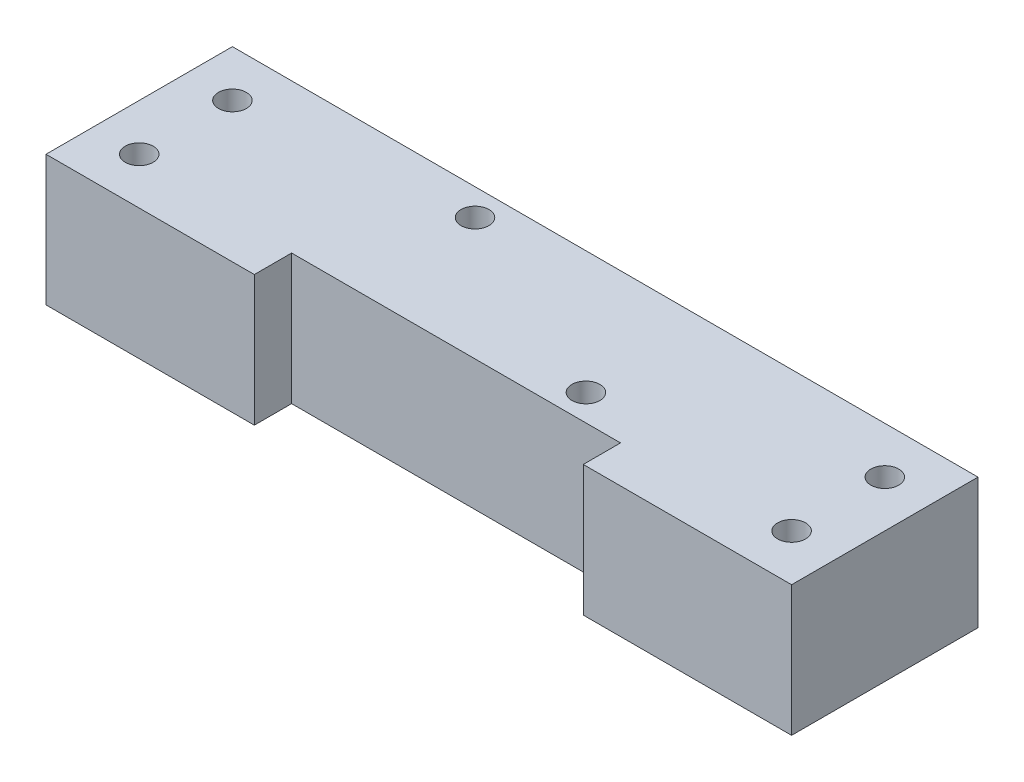
ISO-10303-21;
HEADER;
FILE_DESCRIPTION(('STEP AP214'),'2;1');
FILE_NAME('part.step','',(''),(''),'','','');
FILE_SCHEMA(('AUTOMOTIVE_DESIGN { 1 0 10303 214 1 1 1 1 }'));
ENDSEC;
DATA;
#1=APPLICATION_CONTEXT('core data for automotive mechanical design processes');
#2=APPLICATION_PROTOCOL_DEFINITION('international standard','automotive_design',2000,#1);
#3=PRODUCT_CONTEXT('',#1,'mechanical');
#4=PRODUCT('Part','Part','',(#3));
#5=PRODUCT_RELATED_PRODUCT_CATEGORY('part','',(#4));
#6=PRODUCT_DEFINITION_FORMATION('','',#4);
#7=PRODUCT_DEFINITION_CONTEXT('part definition',#1,'design');
#8=PRODUCT_DEFINITION('design','',#6,#7);
#9=PRODUCT_DEFINITION_SHAPE('','',#8);
#10=(LENGTH_UNIT() NAMED_UNIT(*) SI_UNIT(.MILLI.,.METRE.));
#11=(NAMED_UNIT(*) PLANE_ANGLE_UNIT() SI_UNIT($,.RADIAN.));
#12=(NAMED_UNIT(*) SI_UNIT($,.STERADIAN.) SOLID_ANGLE_UNIT());
#13=UNCERTAINTY_MEASURE_WITH_UNIT(LENGTH_MEASURE(1.E-05),#10,'distance_accuracy_value','');
#14=(GEOMETRIC_REPRESENTATION_CONTEXT(3) GLOBAL_UNCERTAINTY_ASSIGNED_CONTEXT((#13)) GLOBAL_UNIT_ASSIGNED_CONTEXT((#10,
#11,#12)) REPRESENTATION_CONTEXT('',''));
#15=CARTESIAN_POINT('',(0.,0.,0.));
#16=DIRECTION('',(0.,0.,1.));
#17=DIRECTION('',(1.,0.,0.));
#18=AXIS2_PLACEMENT_3D('',#15,#16,#17);
#19=CARTESIAN_POINT('',(0.,0.,20.));
#20=DIRECTION('',(0.,0.,-1.));
#21=DIRECTION('',(-1.,0.,0.));
#22=AXIS2_PLACEMENT_3D('',#19,#20,#21);
#23=PLANE('',#22);
#24=DIRECTION('',(1.,0.,0.));
#25=VECTOR('',#24,1.);
#26=CARTESIAN_POINT('',(0.,0.,20.));
#27=LINE('',#26,#25);
#28=CARTESIAN_POINT('',(0.,0.,20.));
#29=VERTEX_POINT('',#28);
#30=CARTESIAN_POINT('',(22.354,0.,20.));
#31=VERTEX_POINT('',#30);
#32=EDGE_CURVE('E90',#29,#31,#27,.T.);
#33=ORIENTED_EDGE('',*,*,#32,.T.);
#34=DIRECTION('',(0.,-1.,0.));
#35=VECTOR('',#34,1.);
#36=CARTESIAN_POINT('',(22.354,14.,20.));
#37=LINE('',#36,#35);
#38=CARTESIAN_POINT('',(22.354,14.,20.));
#39=VERTEX_POINT('',#38);
#40=EDGE_CURVE('E116',#39,#31,#37,.T.);
#41=ORIENTED_EDGE('',*,*,#40,.F.);
#42=DIRECTION('',(-1.,0.,0.));
#43=VECTOR('',#42,1.);
#44=CARTESIAN_POINT('',(0.,14.,20.));
#45=LINE('',#44,#43);
#46=CARTESIAN_POINT('',(0.,14.,20.));
#47=VERTEX_POINT('',#46);
#48=EDGE_CURVE('E61',#39,#47,#45,.T.);
#49=ORIENTED_EDGE('',*,*,#48,.T.);
#50=DIRECTION('',(0.,-1.,0.));
#51=VECTOR('',#50,1.);
#52=CARTESIAN_POINT('',(0.,0.,20.));
#53=LINE('',#52,#51);
#54=EDGE_CURVE('E147',#47,#29,#53,.T.);
#55=ORIENTED_EDGE('',*,*,#54,.T.);
#56=EDGE_LOOP('',(#33,#41,#49,#55));
#57=FACE_BOUND('',#56,.T.);
#58=ADVANCED_FACE('F37',(#57),#23,.F.);
#59=CARTESIAN_POINT('',(0.,0.,20.));
#60=DIRECTION('',(1.,0.,0.));
#61=DIRECTION('',(0.,0.,-1.));
#62=AXIS2_PLACEMENT_3D('',#59,#60,#61);
#63=PLANE('',#62);
#64=DIRECTION('',(0.,-1.,0.));
#65=VECTOR('',#64,1.);
#66=CARTESIAN_POINT('',(0.,0.,0.));
#67=LINE('',#66,#65);
#68=CARTESIAN_POINT('',(0.,14.,0.));
#69=VERTEX_POINT('',#68);
#70=CARTESIAN_POINT('',(0.,0.,0.));
#71=VERTEX_POINT('',#70);
#72=EDGE_CURVE('E142',#69,#71,#67,.T.);
#73=ORIENTED_EDGE('',*,*,#72,.T.);
#74=DIRECTION('',(0.,0.,-1.));
#75=VECTOR('',#74,1.);
#76=CARTESIAN_POINT('',(0.,0.,20.));
#77=LINE('',#76,#75);
#78=EDGE_CURVE('E11',#29,#71,#77,.T.);
#79=ORIENTED_EDGE('',*,*,#78,.F.);
#80=ORIENTED_EDGE('',*,*,#54,.F.);
#81=DIRECTION('',(0.,0.,-1.));
#82=VECTOR('',#81,1.);
#83=CARTESIAN_POINT('',(0.,14.,20.));
#84=LINE('',#83,#82);
#85=EDGE_CURVE('E156',#47,#69,#84,.T.);
#86=ORIENTED_EDGE('',*,*,#85,.T.);
#87=EDGE_LOOP('',(#73,#79,#80,#86));
#88=FACE_BOUND('',#87,.T.);
#89=ADVANCED_FACE('F39',(#88),#63,.F.);
#90=CARTESIAN_POINT('',(0.,0.,20.));
#91=DIRECTION('',(0.,1.,0.));
#92=DIRECTION('',(0.,0.,1.));
#93=AXIS2_PLACEMENT_3D('',#90,#91,#92);
#94=PLANE('',#93);
#95=CARTESIAN_POINT('',(75.,0.,5.00000000000001));
#96=DIRECTION('',(0.,1.,0.));
#97=DIRECTION('',(0.,0.,-1.));
#98=AXIS2_PLACEMENT_3D('',#95,#96,#97);
#99=CIRCLE('',#98,1.50000000000001);
#100=CARTESIAN_POINT('',(75.,0.,3.49999999999999));
#101=VERTEX_POINT('',#100);
#102=EDGE_CURVE('E246',#101,#101,#99,.T.);
#103=ORIENTED_EDGE('',*,*,#102,.T.);
#104=EDGE_LOOP('',(#103));
#105=FACE_BOUND('',#104,.T.);
#106=CARTESIAN_POINT('',(75.,0.,15.));
#107=DIRECTION('',(0.,1.,0.));
#108=DIRECTION('',(0.,0.,1.));
#109=AXIS2_PLACEMENT_3D('',#106,#107,#108);
#110=CIRCLE('',#109,1.50000000000001);
#111=CARTESIAN_POINT('',(75.,0.,16.5));
#112=VERTEX_POINT('',#111);
#113=EDGE_CURVE('E264',#112,#112,#110,.T.);
#114=ORIENTED_EDGE('',*,*,#113,.T.);
#115=EDGE_LOOP('',(#114));
#116=FACE_BOUND('',#115,.T.);
#117=CARTESIAN_POINT('',(5.,0.,15.));
#118=DIRECTION('',(0.,1.,0.));
#119=DIRECTION('',(0.,0.,-1.));
#120=AXIS2_PLACEMENT_3D('',#117,#118,#119);
#121=CIRCLE('',#120,1.5);
#122=CARTESIAN_POINT('',(5.,0.,13.5));
#123=VERTEX_POINT('',#122);
#124=EDGE_CURVE('E257',#123,#123,#121,.T.);
#125=ORIENTED_EDGE('',*,*,#124,.T.);
#126=EDGE_LOOP('',(#125));
#127=FACE_BOUND('',#126,.T.);
#128=CARTESIAN_POINT('',(5.,0.,5.00000000000002));
#129=DIRECTION('',(0.,1.,0.));
#130=DIRECTION('',(0.,0.,1.));
#131=AXIS2_PLACEMENT_3D('',#128,#129,#130);
#132=CIRCLE('',#131,1.5);
#133=CARTESIAN_POINT('',(5.,0.,6.50000000000001));
#134=VERTEX_POINT('',#133);
#135=EDGE_CURVE('E138',#134,#134,#132,.T.);
#136=ORIENTED_EDGE('',*,*,#135,.T.);
#137=EDGE_LOOP('',(#136));
#138=FACE_BOUND('',#137,.T.);
#139=DIRECTION('',(1.,0.,0.));
#140=VECTOR('',#139,1.);
#141=CARTESIAN_POINT('',(22.354,0.,16.));
#142=LINE('',#141,#140);
#143=CARTESIAN_POINT('',(22.354,0.,16.));
#144=VERTEX_POINT('',#143);
#145=CARTESIAN_POINT('',(57.646,0.,16.));
#146=VERTEX_POINT('',#145);
#147=EDGE_CURVE('E124',#144,#146,#142,.T.);
#148=ORIENTED_EDGE('',*,*,#147,.F.);
#149=DIRECTION('',(0.,0.,1.));
#150=VECTOR('',#149,1.);
#151=CARTESIAN_POINT('',(22.354,0.,16.));
#152=LINE('',#151,#150);
#153=EDGE_CURVE('E111',#144,#31,#152,.T.);
#154=ORIENTED_EDGE('',*,*,#153,.T.);
#155=ORIENTED_EDGE('',*,*,#32,.F.);
#156=ORIENTED_EDGE('',*,*,#78,.T.);
#157=DIRECTION('',(1.,0.,0.));
#158=VECTOR('',#157,1.);
#159=CARTESIAN_POINT('',(0.,0.,0.));
#160=LINE('',#159,#158);
#161=CARTESIAN_POINT('',(80.,0.,0.));
#162=VERTEX_POINT('',#161);
#163=EDGE_CURVE('E159',#71,#162,#160,.T.);
#164=ORIENTED_EDGE('',*,*,#163,.T.);
#165=DIRECTION('',(0.,0.,-1.));
#166=VECTOR('',#165,1.);
#167=CARTESIAN_POINT('',(80.,0.,20.));
#168=LINE('',#167,#166);
#169=CARTESIAN_POINT('',(80.,0.,20.));
#170=VERTEX_POINT('',#169);
#171=EDGE_CURVE('E45',#170,#162,#168,.T.);
#172=ORIENTED_EDGE('',*,*,#171,.F.);
#173=CARTESIAN_POINT('',(57.646,0.,20.));
#174=VERTEX_POINT('',#173);
#175=EDGE_CURVE('E149',#174,#170,#27,.T.);
#176=ORIENTED_EDGE('',*,*,#175,.F.);
#177=DIRECTION('',(0.,0.,1.));
#178=VECTOR('',#177,1.);
#179=CARTESIAN_POINT('',(57.646,0.,16.));
#180=LINE('',#179,#178);
#181=EDGE_CURVE('E52',#146,#174,#180,.T.);
#182=ORIENTED_EDGE('',*,*,#181,.F.);
#183=EDGE_LOOP('',(#148,#154,#155,#156,#164,#172,#176,#182));
#184=FACE_BOUND('',#183,.T.);
#185=ADVANCED_FACE('F129',(#105,#116,#127,#138,#184),#94,.F.);
#186=CARTESIAN_POINT('',(80.,0.,20.));
#187=DIRECTION('',(-1.,0.,0.));
#188=DIRECTION('',(0.,0.,1.));
#189=AXIS2_PLACEMENT_3D('',#186,#187,#188);
#190=PLANE('',#189);
#191=DIRECTION('',(0.,1.,0.));
#192=VECTOR('',#191,1.);
#193=CARTESIAN_POINT('',(80.,0.,0.));
#194=LINE('',#193,#192);
#195=CARTESIAN_POINT('',(80.,14.,0.));
#196=VERTEX_POINT('',#195);
#197=EDGE_CURVE('E161',#162,#196,#194,.T.);
#198=ORIENTED_EDGE('',*,*,#197,.T.);
#199=DIRECTION('',(0.,0.,-1.));
#200=VECTOR('',#199,1.);
#201=CARTESIAN_POINT('',(80.,14.,20.));
#202=LINE('',#201,#200);
#203=CARTESIAN_POINT('',(80.,14.,20.));
#204=VERTEX_POINT('',#203);
#205=EDGE_CURVE('E165',#204,#196,#202,.T.);
#206=ORIENTED_EDGE('',*,*,#205,.F.);
#207=DIRECTION('',(0.,1.,0.));
#208=VECTOR('',#207,1.);
#209=CARTESIAN_POINT('',(80.,0.,20.));
#210=LINE('',#209,#208);
#211=EDGE_CURVE('E151',#170,#204,#210,.T.);
#212=ORIENTED_EDGE('',*,*,#211,.F.);
#213=ORIENTED_EDGE('',*,*,#171,.T.);
#214=EDGE_LOOP('',(#198,#206,#212,#213));
#215=FACE_BOUND('',#214,.T.);
#216=ADVANCED_FACE('F171',(#215),#190,.F.);
#217=CARTESIAN_POINT('',(0.,14.,20.));
#218=DIRECTION('',(0.,-1.,0.));
#219=DIRECTION('',(0.,0.,-1.));
#220=AXIS2_PLACEMENT_3D('',#217,#218,#219);
#221=PLANE('',#220);
#222=CARTESIAN_POINT('',(28.9,14.,2.87));
#223=DIRECTION('',(0.,1.,0.));
#224=DIRECTION('',(0.,0.,1.));
#225=AXIS2_PLACEMENT_3D('',#222,#223,#224);
#226=CIRCLE('',#225,1.5);
#227=CARTESIAN_POINT('',(28.9,14.,4.37));
#228=VERTEX_POINT('',#227);
#229=EDGE_CURVE('E243',#228,#228,#226,.T.);
#230=ORIENTED_EDGE('',*,*,#229,.F.);
#231=EDGE_LOOP('',(#230));
#232=FACE_BOUND('',#231,.T.);
#233=CARTESIAN_POINT('',(51.1,14.,13.17));
#234=DIRECTION('',(0.,1.,0.));
#235=DIRECTION('',(0.,0.,1.));
#236=AXIS2_PLACEMENT_3D('',#233,#234,#235);
#237=CIRCLE('',#236,1.5);
#238=CARTESIAN_POINT('',(51.1,14.,14.67));
#239=VERTEX_POINT('',#238);
#240=EDGE_CURVE('E254',#239,#239,#237,.T.);
#241=ORIENTED_EDGE('',*,*,#240,.F.);
#242=EDGE_LOOP('',(#241));
#243=FACE_BOUND('',#242,.T.);
#244=CARTESIAN_POINT('',(75.,14.,5.00000000000001));
#245=DIRECTION('',(0.,1.,0.));
#246=DIRECTION('',(0.,0.,-1.));
#247=AXIS2_PLACEMENT_3D('',#244,#245,#246);
#248=CIRCLE('',#247,1.50000000000001);
#249=CARTESIAN_POINT('',(75.,14.,3.49999999999999));
#250=VERTEX_POINT('',#249);
#251=EDGE_CURVE('E242',#250,#250,#248,.T.);
#252=ORIENTED_EDGE('',*,*,#251,.F.);
#253=EDGE_LOOP('',(#252));
#254=FACE_BOUND('',#253,.T.);
#255=CARTESIAN_POINT('',(75.,14.,15.));
#256=DIRECTION('',(0.,1.,0.));
#257=DIRECTION('',(0.,0.,1.));
#258=AXIS2_PLACEMENT_3D('',#255,#256,#257);
#259=CIRCLE('',#258,1.50000000000001);
#260=CARTESIAN_POINT('',(75.,14.,16.5));
#261=VERTEX_POINT('',#260);
#262=EDGE_CURVE('E267',#261,#261,#259,.T.);
#263=ORIENTED_EDGE('',*,*,#262,.F.);
#264=EDGE_LOOP('',(#263));
#265=FACE_BOUND('',#264,.T.);
#266=CARTESIAN_POINT('',(5.,14.,15.));
#267=DIRECTION('',(0.,1.,0.));
#268=DIRECTION('',(0.,0.,-1.));
#269=AXIS2_PLACEMENT_3D('',#266,#267,#268);
#270=CIRCLE('',#269,1.5);
#271=CARTESIAN_POINT('',(5.,14.,13.5));
#272=VERTEX_POINT('',#271);
#273=EDGE_CURVE('E261',#272,#272,#270,.T.);
#274=ORIENTED_EDGE('',*,*,#273,.F.);
#275=EDGE_LOOP('',(#274));
#276=FACE_BOUND('',#275,.T.);
#277=CARTESIAN_POINT('',(5.,14.,5.00000000000002));
#278=DIRECTION('',(0.,1.,0.));
#279=DIRECTION('',(0.,0.,1.));
#280=AXIS2_PLACEMENT_3D('',#277,#278,#279);
#281=CIRCLE('',#280,1.5);
#282=CARTESIAN_POINT('',(5.,14.,6.50000000000001));
#283=VERTEX_POINT('',#282);
#284=EDGE_CURVE('E260',#283,#283,#281,.T.);
#285=ORIENTED_EDGE('',*,*,#284,.F.);
#286=EDGE_LOOP('',(#285));
#287=FACE_BOUND('',#286,.T.);
#288=ORIENTED_EDGE('',*,*,#48,.F.);
#289=DIRECTION('',(0.,0.,1.));
#290=VECTOR('',#289,1.);
#291=CARTESIAN_POINT('',(22.354,14.,16.));
#292=LINE('',#291,#290);
#293=CARTESIAN_POINT('',(22.354,14.,16.));
#294=VERTEX_POINT('',#293);
#295=EDGE_CURVE('E140',#294,#39,#292,.T.);
#296=ORIENTED_EDGE('',*,*,#295,.F.);
#297=DIRECTION('',(-1.,0.,0.));
#298=VECTOR('',#297,1.);
#299=CARTESIAN_POINT('',(22.354,14.,16.));
#300=LINE('',#299,#298);
#301=CARTESIAN_POINT('',(57.646,14.,16.));
#302=VERTEX_POINT('',#301);
#303=EDGE_CURVE('E118',#302,#294,#300,.T.);
#304=ORIENTED_EDGE('',*,*,#303,.F.);
#305=DIRECTION('',(0.,0.,1.));
#306=VECTOR('',#305,1.);
#307=CARTESIAN_POINT('',(57.646,14.,16.));
#308=LINE('',#307,#306);
#309=CARTESIAN_POINT('',(57.646,14.,20.));
#310=VERTEX_POINT('',#309);
#311=EDGE_CURVE('E143',#302,#310,#308,.T.);
#312=ORIENTED_EDGE('',*,*,#311,.T.);
#313=EDGE_CURVE('E153',#204,#310,#45,.T.);
#314=ORIENTED_EDGE('',*,*,#313,.F.);
#315=ORIENTED_EDGE('',*,*,#205,.T.);
#316=DIRECTION('',(-1.,0.,0.));
#317=VECTOR('',#316,1.);
#318=CARTESIAN_POINT('',(0.,14.,0.));
#319=LINE('',#318,#317);
#320=EDGE_CURVE('E83',#196,#69,#319,.T.);
#321=ORIENTED_EDGE('',*,*,#320,.T.);
#322=ORIENTED_EDGE('',*,*,#85,.F.);
#323=EDGE_LOOP('',(#288,#296,#304,#312,#314,#315,#321,#322));
#324=FACE_BOUND('',#323,.T.);
#325=ADVANCED_FACE('F179',(#232,#243,#254,#265,#276,#287,#324),#221,.F.);
#326=ORIENTED_EDGE('',*,*,#313,.T.);
#327=DIRECTION('',(0.,1.,0.));
#328=VECTOR('',#327,1.);
#329=CARTESIAN_POINT('',(57.646,14.,20.));
#330=LINE('',#329,#328);
#331=EDGE_CURVE('E127',#174,#310,#330,.T.);
#332=ORIENTED_EDGE('',*,*,#331,.F.);
#333=ORIENTED_EDGE('',*,*,#175,.T.);
#334=ORIENTED_EDGE('',*,*,#211,.T.);
#335=EDGE_LOOP('',(#326,#332,#333,#334));
#336=FACE_BOUND('',#335,.T.);
#337=ADVANCED_FACE('F182',(#336),#23,.F.);
#338=CARTESIAN_POINT('',(0.,0.,0.));
#339=DIRECTION('',(0.,0.,-1.));
#340=DIRECTION('',(-1.,0.,0.));
#341=AXIS2_PLACEMENT_3D('',#338,#339,#340);
#342=PLANE('',#341);
#343=ORIENTED_EDGE('',*,*,#72,.F.);
#344=ORIENTED_EDGE('',*,*,#320,.F.);
#345=ORIENTED_EDGE('',*,*,#197,.F.);
#346=ORIENTED_EDGE('',*,*,#163,.F.);
#347=EDGE_LOOP('',(#343,#344,#345,#346));
#348=FACE_BOUND('',#347,.T.);
#349=ADVANCED_FACE('F175',(#348),#342,.T.);
#350=CARTESIAN_POINT('',(22.354,14.,16.));
#351=DIRECTION('',(-1.,0.,0.));
#352=DIRECTION('',(0.,0.,1.));
#353=AXIS2_PLACEMENT_3D('',#350,#351,#352);
#354=PLANE('',#353);
#355=ORIENTED_EDGE('',*,*,#40,.T.);
#356=ORIENTED_EDGE('',*,*,#153,.F.);
#357=DIRECTION('',(0.,-1.,0.));
#358=VECTOR('',#357,1.);
#359=CARTESIAN_POINT('',(22.354,14.,16.));
#360=LINE('',#359,#358);
#361=EDGE_CURVE('E114',#294,#144,#360,.T.);
#362=ORIENTED_EDGE('',*,*,#361,.F.);
#363=ORIENTED_EDGE('',*,*,#295,.T.);
#364=EDGE_LOOP('',(#355,#356,#362,#363));
#365=FACE_BOUND('',#364,.T.);
#366=ADVANCED_FACE('F113',(#365),#354,.F.);
#367=CARTESIAN_POINT('',(57.646,14.,16.));
#368=DIRECTION('',(1.,0.,0.));
#369=DIRECTION('',(0.,0.,-1.));
#370=AXIS2_PLACEMENT_3D('',#367,#368,#369);
#371=PLANE('',#370);
#372=ORIENTED_EDGE('',*,*,#331,.T.);
#373=ORIENTED_EDGE('',*,*,#311,.F.);
#374=DIRECTION('',(0.,1.,0.));
#375=VECTOR('',#374,1.);
#376=CARTESIAN_POINT('',(57.646,14.,16.));
#377=LINE('',#376,#375);
#378=EDGE_CURVE('E131',#146,#302,#377,.T.);
#379=ORIENTED_EDGE('',*,*,#378,.F.);
#380=ORIENTED_EDGE('',*,*,#181,.T.);
#381=EDGE_LOOP('',(#372,#373,#379,#380));
#382=FACE_BOUND('',#381,.T.);
#383=ADVANCED_FACE('F197',(#382),#371,.F.);
#384=CARTESIAN_POINT('',(0.,0.,16.));
#385=DIRECTION('',(0.,0.,1.));
#386=DIRECTION('',(1.,0.,0.));
#387=AXIS2_PLACEMENT_3D('',#384,#385,#386);
#388=PLANE('',#387);
#389=ORIENTED_EDGE('',*,*,#361,.T.);
#390=ORIENTED_EDGE('',*,*,#147,.T.);
#391=ORIENTED_EDGE('',*,*,#378,.T.);
#392=ORIENTED_EDGE('',*,*,#303,.T.);
#393=EDGE_LOOP('',(#389,#390,#391,#392));
#394=FACE_BOUND('',#393,.T.);
#395=ADVANCED_FACE('F122',(#394),#388,.T.);
#396=CARTESIAN_POINT('',(5.,0.,5.00000000000002));
#397=DIRECTION('',(0.,1.,0.));
#398=DIRECTION('',(0.,0.,1.));
#399=AXIS2_PLACEMENT_3D('',#396,#397,#398);
#400=CYLINDRICAL_SURFACE('',#399,1.5);
#401=ORIENTED_EDGE('',*,*,#135,.F.);
#402=EDGE_LOOP('',(#401));
#403=FACE_BOUND('',#402,.T.);
#404=ORIENTED_EDGE('',*,*,#284,.T.);
#405=EDGE_LOOP('',(#404));
#406=FACE_BOUND('',#405,.T.);
#407=ADVANCED_FACE('F204',(#403,#406),#400,.F.);
#408=CARTESIAN_POINT('',(5.,0.,15.));
#409=DIRECTION('',(0.,1.,0.));
#410=DIRECTION('',(0.,0.,1.));
#411=AXIS2_PLACEMENT_3D('',#408,#409,#410);
#412=CYLINDRICAL_SURFACE('',#411,1.5);
#413=ORIENTED_EDGE('',*,*,#124,.F.);
#414=EDGE_LOOP('',(#413));
#415=FACE_BOUND('',#414,.T.);
#416=ORIENTED_EDGE('',*,*,#273,.T.);
#417=EDGE_LOOP('',(#416));
#418=FACE_BOUND('',#417,.T.);
#419=ADVANCED_FACE('F209',(#415,#418),#412,.F.);
#420=CARTESIAN_POINT('',(75.,0.,15.));
#421=DIRECTION('',(0.,1.,0.));
#422=DIRECTION('',(0.,0.,1.));
#423=AXIS2_PLACEMENT_3D('',#420,#421,#422);
#424=CYLINDRICAL_SURFACE('',#423,1.50000000000001);
#425=ORIENTED_EDGE('',*,*,#113,.F.);
#426=EDGE_LOOP('',(#425));
#427=FACE_BOUND('',#426,.T.);
#428=ORIENTED_EDGE('',*,*,#262,.T.);
#429=EDGE_LOOP('',(#428));
#430=FACE_BOUND('',#429,.T.);
#431=ADVANCED_FACE('F215',(#427,#430),#424,.F.);
#432=CARTESIAN_POINT('',(75.,0.,5.00000000000001));
#433=DIRECTION('',(0.,1.,0.));
#434=DIRECTION('',(0.,0.,1.));
#435=AXIS2_PLACEMENT_3D('',#432,#433,#434);
#436=CYLINDRICAL_SURFACE('',#435,1.50000000000001);
#437=ORIENTED_EDGE('',*,*,#102,.F.);
#438=EDGE_LOOP('',(#437));
#439=FACE_BOUND('',#438,.T.);
#440=ORIENTED_EDGE('',*,*,#251,.T.);
#441=EDGE_LOOP('',(#440));
#442=FACE_BOUND('',#441,.T.);
#443=ADVANCED_FACE('F211',(#439,#442),#436,.F.);
#444=CARTESIAN_POINT('',(51.1,6.,13.17));
#445=DIRECTION('',(0.,1.,0.));
#446=DIRECTION('',(0.,0.,1.));
#447=AXIS2_PLACEMENT_3D('',#444,#445,#446);
#448=CYLINDRICAL_SURFACE('',#447,1.5);
#449=CARTESIAN_POINT('',(51.1,6.,13.17));
#450=DIRECTION('',(0.,1.,0.));
#451=DIRECTION('',(0.,0.,1.));
#452=AXIS2_PLACEMENT_3D('',#449,#450,#451);
#453=CIRCLE('',#452,1.5);
#454=CARTESIAN_POINT('',(51.1,6.,14.67));
#455=VERTEX_POINT('',#454);
#456=EDGE_CURVE('E249',#455,#455,#453,.T.);
#457=ORIENTED_EDGE('',*,*,#456,.F.);
#458=EDGE_LOOP('',(#457));
#459=FACE_BOUND('',#458,.T.);
#460=ORIENTED_EDGE('',*,*,#240,.T.);
#461=EDGE_LOOP('',(#460));
#462=FACE_BOUND('',#461,.T.);
#463=ADVANCED_FACE('F214',(#459,#462),#448,.F.);
#464=CARTESIAN_POINT('',(51.1,6.,13.17));
#465=DIRECTION('',(0.,1.,0.));
#466=DIRECTION('',(0.,0.,1.));
#467=AXIS2_PLACEMENT_3D('',#464,#465,#466);
#468=PLANE('',#467);
#469=ORIENTED_EDGE('',*,*,#456,.T.);
#470=EDGE_LOOP('',(#469));
#471=FACE_BOUND('',#470,.T.);
#472=ADVANCED_FACE('F225',(#471),#468,.T.);
#473=CARTESIAN_POINT('',(28.9,6.,2.87));
#474=DIRECTION('',(0.,1.,0.));
#475=DIRECTION('',(0.,0.,1.));
#476=AXIS2_PLACEMENT_3D('',#473,#474,#475);
#477=CYLINDRICAL_SURFACE('',#476,1.5);
#478=CARTESIAN_POINT('',(28.9,6.,2.87));
#479=DIRECTION('',(0.,1.,0.));
#480=DIRECTION('',(0.,0.,1.));
#481=AXIS2_PLACEMENT_3D('',#478,#479,#480);
#482=CIRCLE('',#481,1.5);
#483=CARTESIAN_POINT('',(28.9,6.,4.37));
#484=VERTEX_POINT('',#483);
#485=EDGE_CURVE('E241',#484,#484,#482,.T.);
#486=ORIENTED_EDGE('',*,*,#485,.F.);
#487=EDGE_LOOP('',(#486));
#488=FACE_BOUND('',#487,.T.);
#489=ORIENTED_EDGE('',*,*,#229,.T.);
#490=EDGE_LOOP('',(#489));
#491=FACE_BOUND('',#490,.T.);
#492=ADVANCED_FACE('F229',(#488,#491),#477,.F.);
#493=CARTESIAN_POINT('',(28.9,6.,2.87));
#494=DIRECTION('',(0.,1.,0.));
#495=DIRECTION('',(0.,0.,1.));
#496=AXIS2_PLACEMENT_3D('',#493,#494,#495);
#497=PLANE('',#496);
#498=ORIENTED_EDGE('',*,*,#485,.T.);
#499=EDGE_LOOP('',(#498));
#500=FACE_BOUND('',#499,.T.);
#501=ADVANCED_FACE('F233',(#500),#497,.T.);
#502=CLOSED_SHELL('',(#58,#89,#185,#216,#325,#337,#349,#366,#383,#395,#407,#419,#431,#443,#463,
#472,#492,#501));
#503=MANIFOLD_SOLID_BREP('B2',#502);
#504=ADVANCED_BREP_SHAPE_REPRESENTATION('',(#18,#503),#14);
#505=SHAPE_DEFINITION_REPRESENTATION(#9,#504);
ENDSEC;
END-ISO-10303-21;
